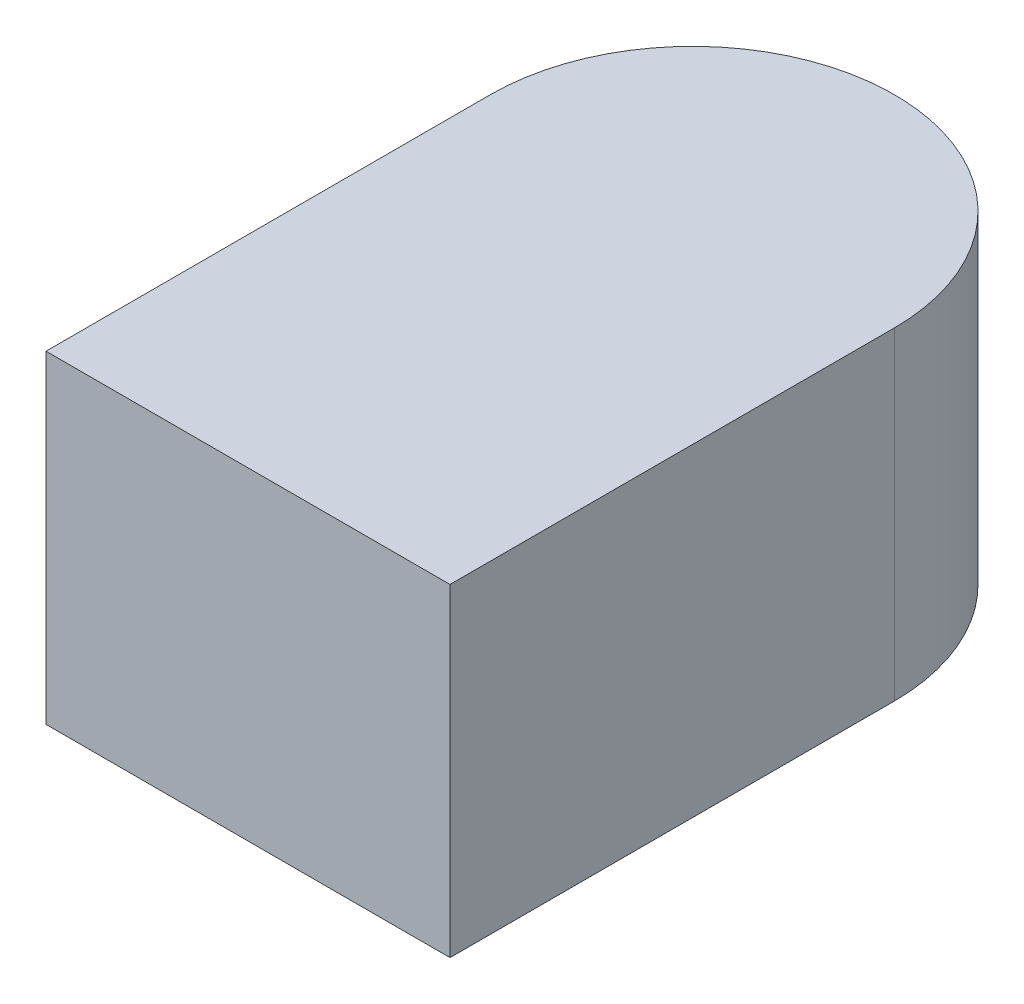
ISO-10303-21;
HEADER;
FILE_DESCRIPTION(('STEP AP214'),'2;1');
FILE_NAME('part.step','',(''),(''),'','','');
FILE_SCHEMA(('AUTOMOTIVE_DESIGN { 1 0 10303 214 1 1 1 1 }'));
ENDSEC;
DATA;
#1=APPLICATION_CONTEXT('core data for automotive mechanical design processes');
#2=APPLICATION_PROTOCOL_DEFINITION('international standard','automotive_design',2000,#1);
#3=PRODUCT_CONTEXT('',#1,'mechanical');
#4=PRODUCT('Part','Part','',(#3));
#5=PRODUCT_RELATED_PRODUCT_CATEGORY('part','',(#4));
#6=PRODUCT_DEFINITION_FORMATION('','',#4);
#7=PRODUCT_DEFINITION_CONTEXT('part definition',#1,'design');
#8=PRODUCT_DEFINITION('design','',#6,#7);
#9=PRODUCT_DEFINITION_SHAPE('','',#8);
#10=(LENGTH_UNIT() NAMED_UNIT(*) SI_UNIT(.MILLI.,.METRE.));
#11=(NAMED_UNIT(*) PLANE_ANGLE_UNIT() SI_UNIT($,.RADIAN.));
#12=(NAMED_UNIT(*) SI_UNIT($,.STERADIAN.) SOLID_ANGLE_UNIT());
#13=UNCERTAINTY_MEASURE_WITH_UNIT(LENGTH_MEASURE(1.E-05),#10,'distance_accuracy_value','');
#14=(GEOMETRIC_REPRESENTATION_CONTEXT(3) GLOBAL_UNCERTAINTY_ASSIGNED_CONTEXT((#13)) GLOBAL_UNIT_ASSIGNED_CONTEXT((#10,
#11,#12)) REPRESENTATION_CONTEXT('',''));
#15=CARTESIAN_POINT('',(0.,0.,0.));
#16=DIRECTION('',(0.,0.,1.));
#17=DIRECTION('',(1.,0.,0.));
#18=AXIS2_PLACEMENT_3D('',#15,#16,#17);
#19=CARTESIAN_POINT('',(0.,0.,0.));
#20=DIRECTION('',(0.,-1.,0.));
#21=DIRECTION('',(1.,0.,0.));
#22=AXIS2_PLACEMENT_3D('',#19,#20,#21);
#23=PLANE('',#22);
#24=CARTESIAN_POINT('',(-0.75,0.,1.225));
#25=DIRECTION('',(0.,-1.,0.));
#26=DIRECTION('',(-1.,0.,0.));
#27=AXIS2_PLACEMENT_3D('',#24,#25,#26);
#28=CIRCLE('',#27,0.125);
#29=CARTESIAN_POINT('',(-0.875,0.,1.225));
#30=VERTEX_POINT('',#29);
#31=CARTESIAN_POINT('',(-0.625,0.,1.225));
#32=VERTEX_POINT('',#31);
#33=EDGE_CURVE('E11',#30,#32,#28,.T.);
#34=ORIENTED_EDGE('',*,*,#33,.T.);
#35=DIRECTION('',(0.,0.,1.));
#36=VECTOR('',#35,1.);
#37=CARTESIAN_POINT('',(-0.625,0.,1.225));
#38=LINE('',#37,#36);
#39=CARTESIAN_POINT('',(-0.625,0.,1.5));
#40=VERTEX_POINT('',#39);
#41=EDGE_CURVE('E24',#32,#40,#38,.T.);
#42=ORIENTED_EDGE('',*,*,#41,.T.);
#43=DIRECTION('',(-1.,0.,0.));
#44=VECTOR('',#43,1.);
#45=CARTESIAN_POINT('',(-0.625,0.,1.5));
#46=LINE('',#45,#44);
#47=CARTESIAN_POINT('',(-0.875,0.,1.5));
#48=VERTEX_POINT('',#47);
#49=EDGE_CURVE('E62',#40,#48,#46,.T.);
#50=ORIENTED_EDGE('',*,*,#49,.T.);
#51=DIRECTION('',(0.,0.,-1.));
#52=VECTOR('',#51,1.);
#53=CARTESIAN_POINT('',(-0.875,0.,1.5));
#54=LINE('',#53,#52);
#55=EDGE_CURVE('E36',#48,#30,#54,.T.);
#56=ORIENTED_EDGE('',*,*,#55,.T.);
#57=EDGE_LOOP('',(#34,#42,#50,#56));
#58=FACE_BOUND('',#57,.T.);
#59=ADVANCED_FACE('F17',(#58),#23,.T.);
#60=CARTESIAN_POINT('',(-0.875,0.,1.5));
#61=DIRECTION('',(1.,0.,0.));
#62=DIRECTION('',(0.,0.,-1.));
#63=AXIS2_PLACEMENT_3D('',#60,#61,#62);
#64=PLANE('',#63);
#65=DIRECTION('',(0.,1.,0.));
#66=VECTOR('',#65,1.);
#67=CARTESIAN_POINT('',(-0.875,0.,1.5));
#68=LINE('',#67,#66);
#69=CARTESIAN_POINT('',(-0.875,0.2,1.5));
#70=VERTEX_POINT('',#69);
#71=EDGE_CURVE('E84',#48,#70,#68,.T.);
#72=ORIENTED_EDGE('',*,*,#71,.T.);
#73=DIRECTION('',(0.,0.,-1.));
#74=VECTOR('',#73,1.);
#75=CARTESIAN_POINT('',(-0.875,0.2,1.5));
#76=LINE('',#75,#74);
#77=CARTESIAN_POINT('',(-0.875,0.2,1.225));
#78=VERTEX_POINT('',#77);
#79=EDGE_CURVE('E74',#70,#78,#76,.T.);
#80=ORIENTED_EDGE('',*,*,#79,.T.);
#81=DIRECTION('',(0.,1.,0.));
#82=VECTOR('',#81,1.);
#83=CARTESIAN_POINT('',(-0.875,0.,1.225));
#84=LINE('',#83,#82);
#85=EDGE_CURVE('E81',#30,#78,#84,.T.);
#86=ORIENTED_EDGE('',*,*,#85,.F.);
#87=ORIENTED_EDGE('',*,*,#55,.F.);
#88=EDGE_LOOP('',(#72,#80,#86,#87));
#89=FACE_BOUND('',#88,.T.);
#90=ADVANCED_FACE('F91',(#89),#64,.F.);
#91=CARTESIAN_POINT('',(-0.75,0.,1.225));
#92=DIRECTION('',(0.,-1.,0.));
#93=DIRECTION('',(1.,0.,0.));
#94=AXIS2_PLACEMENT_3D('',#91,#92,#93);
#95=CYLINDRICAL_SURFACE('',#94,0.125);
#96=ORIENTED_EDGE('',*,*,#85,.T.);
#97=CARTESIAN_POINT('',(-0.75,0.2,1.225));
#98=DIRECTION('',(0.,-1.,0.));
#99=DIRECTION('',(-1.,0.,0.));
#100=AXIS2_PLACEMENT_3D('',#97,#98,#99);
#101=CIRCLE('',#100,0.125);
#102=CARTESIAN_POINT('',(-0.625,0.2,1.225));
#103=VERTEX_POINT('',#102);
#104=EDGE_CURVE('E79',#78,#103,#101,.T.);
#105=ORIENTED_EDGE('',*,*,#104,.T.);
#106=DIRECTION('',(0.,1.,0.));
#107=VECTOR('',#106,1.);
#108=CARTESIAN_POINT('',(-0.625,0.,1.225));
#109=LINE('',#108,#107);
#110=EDGE_CURVE('E68',#32,#103,#109,.T.);
#111=ORIENTED_EDGE('',*,*,#110,.F.);
#112=ORIENTED_EDGE('',*,*,#33,.F.);
#113=EDGE_LOOP('',(#96,#105,#111,#112));
#114=FACE_BOUND('',#113,.T.);
#115=ADVANCED_FACE('F89',(#114),#95,.T.);
#116=CARTESIAN_POINT('',(-0.625,0.,1.225));
#117=DIRECTION('',(-1.,0.,0.));
#118=DIRECTION('',(0.,0.,1.));
#119=AXIS2_PLACEMENT_3D('',#116,#117,#118);
#120=PLANE('',#119);
#121=ORIENTED_EDGE('',*,*,#110,.T.);
#122=DIRECTION('',(0.,0.,1.));
#123=VECTOR('',#122,1.);
#124=CARTESIAN_POINT('',(-0.625,0.2,1.225));
#125=LINE('',#124,#123);
#126=CARTESIAN_POINT('',(-0.625,0.2,1.5));
#127=VERTEX_POINT('',#126);
#128=EDGE_CURVE('E63',#103,#127,#125,.T.);
#129=ORIENTED_EDGE('',*,*,#128,.T.);
#130=DIRECTION('',(0.,1.,0.));
#131=VECTOR('',#130,1.);
#132=CARTESIAN_POINT('',(-0.625,0.,1.5));
#133=LINE('',#132,#131);
#134=EDGE_CURVE('E56',#40,#127,#133,.T.);
#135=ORIENTED_EDGE('',*,*,#134,.F.);
#136=ORIENTED_EDGE('',*,*,#41,.F.);
#137=EDGE_LOOP('',(#121,#129,#135,#136));
#138=FACE_BOUND('',#137,.T.);
#139=ADVANCED_FACE('F66',(#138),#120,.F.);
#140=CARTESIAN_POINT('',(-0.625,0.,1.5));
#141=DIRECTION('',(0.,0.,-1.));
#142=DIRECTION('',(-1.,0.,0.));
#143=AXIS2_PLACEMENT_3D('',#140,#141,#142);
#144=PLANE('',#143);
#145=ORIENTED_EDGE('',*,*,#134,.T.);
#146=DIRECTION('',(-1.,0.,0.));
#147=VECTOR('',#146,1.);
#148=CARTESIAN_POINT('',(-0.625,0.2,1.5));
#149=LINE('',#148,#147);
#150=EDGE_CURVE('E61',#127,#70,#149,.T.);
#151=ORIENTED_EDGE('',*,*,#150,.T.);
#152=ORIENTED_EDGE('',*,*,#71,.F.);
#153=ORIENTED_EDGE('',*,*,#49,.F.);
#154=EDGE_LOOP('',(#145,#151,#152,#153));
#155=FACE_BOUND('',#154,.T.);
#156=ADVANCED_FACE('F58',(#155),#144,.F.);
#157=CARTESIAN_POINT('',(0.,0.2,0.));
#158=DIRECTION('',(0.,-1.,0.));
#159=DIRECTION('',(1.,0.,0.));
#160=AXIS2_PLACEMENT_3D('',#157,#158,#159);
#161=PLANE('',#160);
#162=ORIENTED_EDGE('',*,*,#150,.F.);
#163=ORIENTED_EDGE('',*,*,#128,.F.);
#164=ORIENTED_EDGE('',*,*,#104,.F.);
#165=ORIENTED_EDGE('',*,*,#79,.F.);
#166=EDGE_LOOP('',(#162,#163,#164,#165));
#167=FACE_BOUND('',#166,.T.);
#168=ADVANCED_FACE('F72',(#167),#161,.F.);
#169=CLOSED_SHELL('',(#59,#90,#115,#139,#156,#168));
#170=MANIFOLD_SOLID_BREP('B1',#169);
#171=ADVANCED_BREP_SHAPE_REPRESENTATION('',(#18,#170),#14);
#172=SHAPE_DEFINITION_REPRESENTATION(#9,#171);
ENDSEC;
END-ISO-10303-21;
